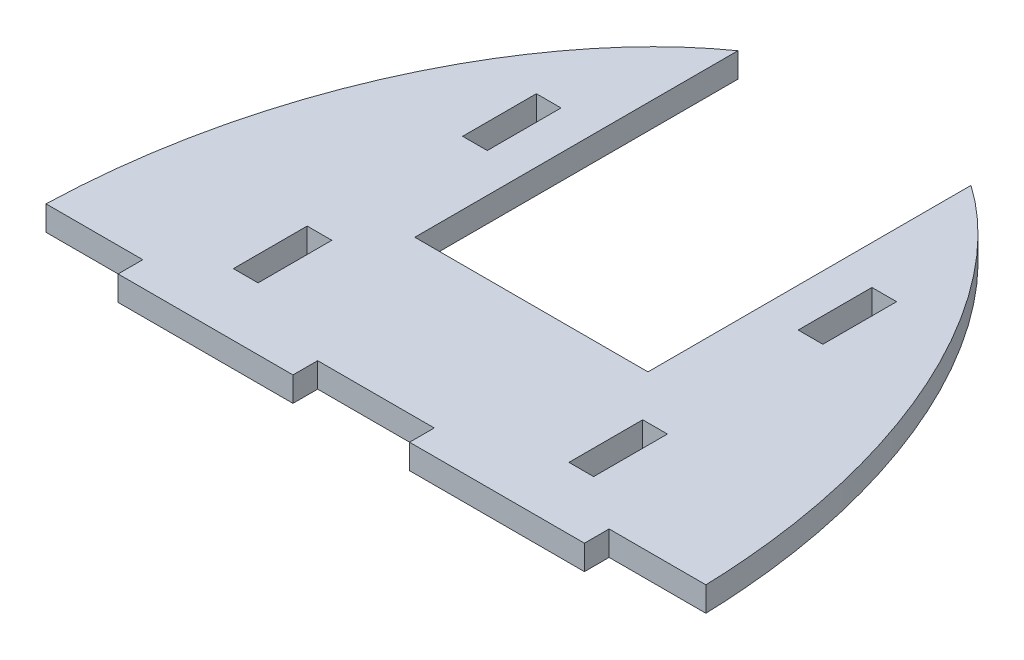
ISO-10303-21;
HEADER;
FILE_DESCRIPTION(('STEP AP214'),'2;1');
FILE_NAME('part.step','',(''),(''),'','','');
FILE_SCHEMA(('AUTOMOTIVE_DESIGN { 1 0 10303 214 1 1 1 1 }'));
ENDSEC;
DATA;
#1=APPLICATION_CONTEXT('core data for automotive mechanical design processes');
#2=APPLICATION_PROTOCOL_DEFINITION('international standard','automotive_design',2000,#1);
#3=PRODUCT_CONTEXT('',#1,'mechanical');
#4=PRODUCT('Part','Part','',(#3));
#5=PRODUCT_RELATED_PRODUCT_CATEGORY('part','',(#4));
#6=PRODUCT_DEFINITION_FORMATION('','',#4);
#7=PRODUCT_DEFINITION_CONTEXT('part definition',#1,'design');
#8=PRODUCT_DEFINITION('design','',#6,#7);
#9=PRODUCT_DEFINITION_SHAPE('','',#8);
#10=(LENGTH_UNIT() NAMED_UNIT(*) SI_UNIT(.MILLI.,.METRE.));
#11=(NAMED_UNIT(*) PLANE_ANGLE_UNIT() SI_UNIT($,.RADIAN.));
#12=(NAMED_UNIT(*) SI_UNIT($,.STERADIAN.) SOLID_ANGLE_UNIT());
#13=UNCERTAINTY_MEASURE_WITH_UNIT(LENGTH_MEASURE(1.E-05),#10,'distance_accuracy_value','');
#14=(GEOMETRIC_REPRESENTATION_CONTEXT(3) GLOBAL_UNCERTAINTY_ASSIGNED_CONTEXT((#13)) GLOBAL_UNIT_ASSIGNED_CONTEXT((#10,
#11,#12)) REPRESENTATION_CONTEXT('',''));
#15=CARTESIAN_POINT('',(0.,0.,0.));
#16=DIRECTION('',(0.,0.,1.));
#17=DIRECTION('',(1.,0.,0.));
#18=AXIS2_PLACEMENT_3D('',#15,#16,#17);
#19=CARTESIAN_POINT('',(0.,3.175,0.));
#20=CARTESIAN_POINT('',(0.,3.175,-36.));
#21=CARTESIAN_POINT('',(22.55,3.175,-70.2833333333334));
#22=CARTESIAN_POINT('',(62.4500000000001,3.175,-70.2833333333333));
#23=CARTESIAN_POINT('',(85.,3.175,-36.0000000000004));
#24=CARTESIAN_POINT('',(85.,3.175,1.08663078535189E-13));
#25=B_SPLINE_CURVE_WITH_KNOTS('',3,(#19,#20,#21,#22,#23,#24),.UNSPECIFIED.,.F.,.F.,(4,1,1,4),
(0.,0.449999999999999,0.549999999999999,1.),.UNSPECIFIED.);
#26=DIRECTION('',(0.,-1.,0.));
#27=VECTOR('',#26,1.);
#28=SURFACE_OF_LINEAR_EXTRUSION('',#25,#27);
#29=DIRECTION('',(0.,-1.,0.));
#30=VECTOR('',#29,1.);
#31=CARTESIAN_POINT('',(0.0479908800301358,3.175,-3.175));
#32=LINE('',#31,#30);
#33=CARTESIAN_POINT('',(0.0479908800301429,3.175,-3.175));
#34=VERTEX_POINT('',#33);
#35=CARTESIAN_POINT('',(0.0479908800301429,0.,-3.175));
#36=VERTEX_POINT('',#35);
#37=EDGE_CURVE('E309',#34,#36,#32,.T.);
#38=ORIENTED_EDGE('',*,*,#37,.F.);
#39=CARTESIAN_POINT('',(27.5,3.175,-64.7387374641124));
#40=VERTEX_POINT('',#39);
#41=EDGE_CURVE('E278',#34,#40,#25,.T.);
#42=ORIENTED_EDGE('',*,*,#41,.T.);
#43=DIRECTION('',(0.,-1.,0.));
#44=VECTOR('',#43,1.);
#45=CARTESIAN_POINT('',(27.5,3.175,-64.7387374694165));
#46=LINE('',#45,#44);
#47=CARTESIAN_POINT('',(27.5,0.,-64.7387374641124));
#48=VERTEX_POINT('',#47);
#49=EDGE_CURVE('E323',#48,#40,#46,.F.);
#50=ORIENTED_EDGE('',*,*,#49,.F.);
#51=CARTESIAN_POINT('',(0.,0.,0.));
#52=CARTESIAN_POINT('',(0.,0.,-36.));
#53=CARTESIAN_POINT('',(22.55,0.,-70.2833333333334));
#54=CARTESIAN_POINT('',(62.4500000000001,0.,-70.2833333333333));
#55=CARTESIAN_POINT('',(85.,0.,-36.0000000000004));
#56=CARTESIAN_POINT('',(85.,0.,1.08663078535189E-13));
#57=B_SPLINE_CURVE_WITH_KNOTS('',3,(#51,#52,#53,#54,#55,#56),.UNSPECIFIED.,.F.,.F.,(4,1,1,4),
(0.,0.449999999999999,0.549999999999999,1.),.UNSPECIFIED.);
#58=EDGE_CURVE('E259',#36,#48,#57,.T.);
#59=ORIENTED_EDGE('',*,*,#58,.F.);
#60=EDGE_LOOP('',(#38,#42,#50,#59));
#61=FACE_BOUND('',#60,.T.);
#62=ADVANCED_FACE('F34',(#61),#28,.T.);
#63=CARTESIAN_POINT('',(0.,3.175,0.));
#64=DIRECTION('',(0.,0.,-1.));
#65=DIRECTION('',(-1.,0.,0.));
#66=AXIS2_PLACEMENT_3D('',#63,#64,#65);
#67=PLANE('',#66);
#68=DIRECTION('',(1.,0.,0.));
#69=VECTOR('',#68,1.);
#70=CARTESIAN_POINT('',(0.,3.175,0.));
#71=LINE('',#70,#69);
#72=CARTESIAN_POINT('',(12.5,3.175,0.));
#73=VERTEX_POINT('',#72);
#74=CARTESIAN_POINT('',(35.,3.175,0.));
#75=VERTEX_POINT('',#74);
#76=EDGE_CURVE('E270',#73,#75,#71,.T.);
#77=ORIENTED_EDGE('',*,*,#76,.F.);
#78=DIRECTION('',(0.,1.,0.));
#79=VECTOR('',#78,1.);
#80=CARTESIAN_POINT('',(12.5,0.,0.));
#81=LINE('',#80,#79);
#82=CARTESIAN_POINT('',(12.5,0.,0.));
#83=VERTEX_POINT('',#82);
#84=EDGE_CURVE('E444',#83,#73,#81,.T.);
#85=ORIENTED_EDGE('',*,*,#84,.F.);
#86=DIRECTION('',(1.,0.,0.));
#87=VECTOR('',#86,1.);
#88=CARTESIAN_POINT('',(0.,0.,0.));
#89=LINE('',#88,#87);
#90=CARTESIAN_POINT('',(35.,0.,0.));
#91=VERTEX_POINT('',#90);
#92=EDGE_CURVE('E258',#83,#91,#89,.T.);
#93=ORIENTED_EDGE('',*,*,#92,.T.);
#94=DIRECTION('',(0.,1.,0.));
#95=VECTOR('',#94,1.);
#96=CARTESIAN_POINT('',(35.,0.,0.));
#97=LINE('',#96,#95);
#98=EDGE_CURVE('E420',#91,#75,#97,.T.);
#99=ORIENTED_EDGE('',*,*,#98,.T.);
#100=EDGE_LOOP('',(#77,#85,#93,#99));
#101=FACE_BOUND('',#100,.T.);
#102=ADVANCED_FACE('F496',(#101),#67,.F.);
#103=DIRECTION('',(0.,-1.,0.));
#104=VECTOR('',#103,1.);
#105=CARTESIAN_POINT('',(84.9520091199699,3.175,-3.17499999999997));
#106=LINE('',#105,#104);
#107=CARTESIAN_POINT('',(84.9520091199699,0.,-3.175));
#108=VERTEX_POINT('',#107);
#109=CARTESIAN_POINT('',(84.9520091199699,3.175,-3.175));
#110=VERTEX_POINT('',#109);
#111=EDGE_CURVE('E321',#108,#110,#106,.F.);
#112=ORIENTED_EDGE('',*,*,#111,.F.);
#113=CARTESIAN_POINT('',(57.5,0.,-64.7387374641124));
#114=VERTEX_POINT('',#113);
#115=EDGE_CURVE('E264',#114,#108,#57,.T.);
#116=ORIENTED_EDGE('',*,*,#115,.F.);
#117=DIRECTION('',(0.,-1.,0.));
#118=VECTOR('',#117,1.);
#119=CARTESIAN_POINT('',(57.5,3.175,-64.7387374694166));
#120=LINE('',#119,#118);
#121=CARTESIAN_POINT('',(57.5,3.175,-64.7387374641124));
#122=VERTEX_POINT('',#121);
#123=EDGE_CURVE('E325',#122,#114,#120,.T.);
#124=ORIENTED_EDGE('',*,*,#123,.F.);
#125=EDGE_CURVE('E262',#122,#110,#25,.T.);
#126=ORIENTED_EDGE('',*,*,#125,.T.);
#127=EDGE_LOOP('',(#112,#116,#124,#126));
#128=FACE_BOUND('',#127,.T.);
#129=ADVANCED_FACE('F36',(#128),#28,.T.);
#130=CARTESIAN_POINT('',(50.,3.175,0.));
#131=VERTEX_POINT('',#130);
#132=CARTESIAN_POINT('',(72.5,3.175,0.));
#133=VERTEX_POINT('',#132);
#134=EDGE_CURVE('E273',#131,#133,#71,.T.);
#135=ORIENTED_EDGE('',*,*,#134,.F.);
#136=DIRECTION('',(0.,1.,0.));
#137=VECTOR('',#136,1.);
#138=CARTESIAN_POINT('',(50.,0.,0.));
#139=LINE('',#138,#137);
#140=CARTESIAN_POINT('',(50.,0.,0.));
#141=VERTEX_POINT('',#140);
#142=EDGE_CURVE('E257',#141,#131,#139,.T.);
#143=ORIENTED_EDGE('',*,*,#142,.F.);
#144=CARTESIAN_POINT('',(72.5,0.,0.));
#145=VERTEX_POINT('',#144);
#146=EDGE_CURVE('E252',#141,#145,#89,.T.);
#147=ORIENTED_EDGE('',*,*,#146,.T.);
#148=DIRECTION('',(0.,1.,0.));
#149=VECTOR('',#148,1.);
#150=CARTESIAN_POINT('',(72.5,0.,0.));
#151=LINE('',#150,#149);
#152=EDGE_CURVE('E231',#145,#133,#151,.T.);
#153=ORIENTED_EDGE('',*,*,#152,.T.);
#154=EDGE_LOOP('',(#135,#143,#147,#153));
#155=FACE_BOUND('',#154,.T.);
#156=ADVANCED_FACE('F256',(#155),#67,.F.);
#157=CARTESIAN_POINT('',(0.,3.175,0.));
#158=DIRECTION('',(0.,1.,0.));
#159=DIRECTION('',(0.,0.,1.));
#160=AXIS2_PLACEMENT_3D('',#157,#158,#159);
#161=PLANE('',#160);
#162=DIRECTION('',(-1.,0.,0.));
#163=VECTOR('',#162,1.);
#164=CARTESIAN_POINT('',(0.,3.175,-3.175));
#165=LINE('',#164,#163);
#166=CARTESIAN_POINT('',(12.5,3.175,-3.175));
#167=VERTEX_POINT('',#166);
#168=EDGE_CURVE('E448',#167,#34,#165,.T.);
#169=ORIENTED_EDGE('',*,*,#168,.F.);
#170=DIRECTION('',(0.,0.,-1.));
#171=VECTOR('',#170,1.);
#172=CARTESIAN_POINT('',(12.5,3.175,0.));
#173=LINE('',#172,#171);
#174=EDGE_CURVE('E429',#73,#167,#173,.T.);
#175=ORIENTED_EDGE('',*,*,#174,.F.);
#176=ORIENTED_EDGE('',*,*,#76,.T.);
#177=DIRECTION('',(0.,0.,1.));
#178=VECTOR('',#177,1.);
#179=CARTESIAN_POINT('',(35.,3.175,0.));
#180=LINE('',#179,#178);
#181=CARTESIAN_POINT('',(35.,3.175,-3.175));
#182=VERTEX_POINT('',#181);
#183=EDGE_CURVE('E243',#182,#75,#180,.T.);
#184=ORIENTED_EDGE('',*,*,#183,.F.);
#185=DIRECTION('',(-1.,0.,0.));
#186=VECTOR('',#185,1.);
#187=CARTESIAN_POINT('',(35.,3.175,-3.175));
#188=LINE('',#187,#186);
#189=CARTESIAN_POINT('',(50.,3.175,-3.175));
#190=VERTEX_POINT('',#189);
#191=EDGE_CURVE('E430',#190,#182,#188,.T.);
#192=ORIENTED_EDGE('',*,*,#191,.F.);
#193=DIRECTION('',(0.,0.,-1.));
#194=VECTOR('',#193,1.);
#195=CARTESIAN_POINT('',(50.,3.175,0.));
#196=LINE('',#195,#194);
#197=EDGE_CURVE('E434',#131,#190,#196,.T.);
#198=ORIENTED_EDGE('',*,*,#197,.F.);
#199=ORIENTED_EDGE('',*,*,#134,.T.);
#200=DIRECTION('',(0.,0.,1.));
#201=VECTOR('',#200,1.);
#202=CARTESIAN_POINT('',(72.5,3.175,0.));
#203=LINE('',#202,#201);
#204=CARTESIAN_POINT('',(72.5,3.175,-3.175));
#205=VERTEX_POINT('',#204);
#206=EDGE_CURVE('E238',#205,#133,#203,.T.);
#207=ORIENTED_EDGE('',*,*,#206,.F.);
#208=DIRECTION('',(-1.,0.,0.));
#209=VECTOR('',#208,1.);
#210=CARTESIAN_POINT('',(85.,3.175,-3.175));
#211=LINE('',#210,#209);
#212=EDGE_CURVE('E462',#110,#205,#211,.T.);
#213=ORIENTED_EDGE('',*,*,#212,.F.);
#214=ORIENTED_EDGE('',*,*,#125,.F.);
#215=DIRECTION('',(0.,0.,-1.));
#216=VECTOR('',#215,1.);
#217=CARTESIAN_POINT('',(57.5,3.175,-78.2349171873449));
#218=LINE('',#217,#216);
#219=CARTESIAN_POINT('',(57.5,3.175,-23.175));
#220=VERTEX_POINT('',#219);
#221=EDGE_CURVE('E463',#220,#122,#218,.T.);
#222=ORIENTED_EDGE('',*,*,#221,.F.);
#223=DIRECTION('',(1.,0.,0.));
#224=VECTOR('',#223,1.);
#225=CARTESIAN_POINT('',(27.5,3.175,-23.175));
#226=LINE('',#225,#224);
#227=CARTESIAN_POINT('',(27.5,3.175,-23.175));
#228=VERTEX_POINT('',#227);
#229=EDGE_CURVE('E466',#228,#220,#226,.T.);
#230=ORIENTED_EDGE('',*,*,#229,.F.);
#231=DIRECTION('',(0.,0.,1.));
#232=VECTOR('',#231,1.);
#233=CARTESIAN_POINT('',(27.5,3.175,-78.2349171873449));
#234=LINE('',#233,#232);
#235=EDGE_CURVE('E469',#40,#228,#234,.T.);
#236=ORIENTED_EDGE('',*,*,#235,.F.);
#237=ORIENTED_EDGE('',*,*,#41,.F.);
#238=EDGE_LOOP('',(#169,#175,#176,#184,#192,#198,#199,#207,#213,#214,#222,#230,#236,#237));
#239=FACE_BOUND('',#238,.T.);
#240=DIRECTION('',(0.,0.,1.));
#241=VECTOR('',#240,1.);
#242=CARTESIAN_POINT('',(62.5000000000007,3.175,-17.5));
#243=LINE('',#242,#241);
#244=CARTESIAN_POINT('',(62.5000000000007,3.175,-17.5));
#245=VERTEX_POINT('',#244);
#246=CARTESIAN_POINT('',(62.5000000000007,3.175,-8.008));
#247=VERTEX_POINT('',#246);
#248=EDGE_CURVE('E50',#245,#247,#243,.T.);
#249=ORIENTED_EDGE('',*,*,#248,.F.);
#250=DIRECTION('',(-1.,0.,0.));
#251=VECTOR('',#250,1.);
#252=CARTESIAN_POINT('',(62.5000000000007,3.175,-17.5));
#253=LINE('',#252,#251);
#254=CARTESIAN_POINT('',(65.6750000000006,3.175,-17.5));
#255=VERTEX_POINT('',#254);
#256=EDGE_CURVE('E337',#255,#245,#253,.T.);
#257=ORIENTED_EDGE('',*,*,#256,.F.);
#258=DIRECTION('',(0.,0.,-1.));
#259=VECTOR('',#258,1.);
#260=CARTESIAN_POINT('',(65.6750000000006,3.175,-17.5));
#261=LINE('',#260,#259);
#262=CARTESIAN_POINT('',(65.6750000000006,3.175,-8.008));
#263=VERTEX_POINT('',#262);
#264=EDGE_CURVE('E341',#263,#255,#261,.T.);
#265=ORIENTED_EDGE('',*,*,#264,.F.);
#266=DIRECTION('',(1.,0.,0.));
#267=VECTOR('',#266,1.);
#268=CARTESIAN_POINT('',(62.5000000000007,3.175,-8.008));
#269=LINE('',#268,#267);
#270=EDGE_CURVE('E344',#247,#263,#269,.T.);
#271=ORIENTED_EDGE('',*,*,#270,.F.);
#272=EDGE_LOOP('',(#249,#257,#265,#271));
#273=FACE_BOUND('',#272,.T.);
#274=DIRECTION('',(0.,0.,1.));
#275=VECTOR('',#274,1.);
#276=CARTESIAN_POINT('',(19.3250000000006,3.175,-17.5));
#277=LINE('',#276,#275);
#278=CARTESIAN_POINT('',(19.3250000000006,3.175,-17.5));
#279=VERTEX_POINT('',#278);
#280=CARTESIAN_POINT('',(19.3250000000007,3.175,-8.008));
#281=VERTEX_POINT('',#280);
#282=EDGE_CURVE('E58',#279,#281,#277,.T.);
#283=ORIENTED_EDGE('',*,*,#282,.F.);
#284=DIRECTION('',(-1.,0.,0.));
#285=VECTOR('',#284,1.);
#286=CARTESIAN_POINT('',(19.3250000000006,3.175,-17.5));
#287=LINE('',#286,#285);
#288=CARTESIAN_POINT('',(22.5000000000006,3.175,-17.5));
#289=VERTEX_POINT('',#288);
#290=EDGE_CURVE('E369',#289,#279,#287,.T.);
#291=ORIENTED_EDGE('',*,*,#290,.F.);
#292=DIRECTION('',(0.,0.,-1.));
#293=VECTOR('',#292,1.);
#294=CARTESIAN_POINT('',(22.5000000000006,3.175,-17.5));
#295=LINE('',#294,#293);
#296=CARTESIAN_POINT('',(22.5000000000006,3.175,-8.008));
#297=VERTEX_POINT('',#296);
#298=EDGE_CURVE('E373',#297,#289,#295,.T.);
#299=ORIENTED_EDGE('',*,*,#298,.F.);
#300=DIRECTION('',(1.,0.,0.));
#301=VECTOR('',#300,1.);
#302=CARTESIAN_POINT('',(19.3250000000007,3.175,-8.008));
#303=LINE('',#302,#301);
#304=EDGE_CURVE('E376',#281,#297,#303,.T.);
#305=ORIENTED_EDGE('',*,*,#304,.F.);
#306=EDGE_LOOP('',(#283,#291,#299,#305));
#307=FACE_BOUND('',#306,.T.);
#308=DIRECTION('',(0.,0.,1.));
#309=VECTOR('',#308,1.);
#310=CARTESIAN_POINT('',(62.5000000000009,3.175,-46.992));
#311=LINE('',#310,#309);
#312=CARTESIAN_POINT('',(62.5000000000009,3.175,-46.992));
#313=VERTEX_POINT('',#312);
#314=CARTESIAN_POINT('',(62.5000000000009,3.175,-37.5));
#315=VERTEX_POINT('',#314);
#316=EDGE_CURVE('E368',#313,#315,#311,.T.);
#317=ORIENTED_EDGE('',*,*,#316,.F.);
#318=DIRECTION('',(-1.,0.,0.));
#319=VECTOR('',#318,1.);
#320=CARTESIAN_POINT('',(62.5000000000009,3.175,-46.992));
#321=LINE('',#320,#319);
#322=CARTESIAN_POINT('',(65.6750000000008,3.175,-46.992));
#323=VERTEX_POINT('',#322);
#324=EDGE_CURVE('E399',#323,#313,#321,.T.);
#325=ORIENTED_EDGE('',*,*,#324,.F.);
#326=DIRECTION('',(0.,0.,-1.));
#327=VECTOR('',#326,1.);
#328=CARTESIAN_POINT('',(65.6750000000008,3.175,-46.992));
#329=LINE('',#328,#327);
#330=CARTESIAN_POINT('',(65.6750000000008,3.175,-37.5));
#331=VERTEX_POINT('',#330);
#332=EDGE_CURVE('E403',#331,#323,#329,.T.);
#333=ORIENTED_EDGE('',*,*,#332,.F.);
#334=DIRECTION('',(1.,0.,0.));
#335=VECTOR('',#334,1.);
#336=CARTESIAN_POINT('',(62.5000000000009,3.175,-37.5));
#337=LINE('',#336,#335);
#338=EDGE_CURVE('E406',#315,#331,#337,.T.);
#339=ORIENTED_EDGE('',*,*,#338,.F.);
#340=EDGE_LOOP('',(#317,#325,#333,#339));
#341=FACE_BOUND('',#340,.T.);
#342=DIRECTION('',(0.,0.,1.));
#343=VECTOR('',#342,1.);
#344=CARTESIAN_POINT('',(19.3250000000009,3.175,-46.992));
#345=LINE('',#344,#343);
#346=CARTESIAN_POINT('',(19.3250000000009,3.175,-46.992));
#347=VERTEX_POINT('',#346);
#348=CARTESIAN_POINT('',(19.3250000000008,3.175,-37.5));
#349=VERTEX_POINT('',#348);
#350=EDGE_CURVE('E307',#347,#349,#345,.T.);
#351=ORIENTED_EDGE('',*,*,#350,.F.);
#352=DIRECTION('',(-1.,0.,0.));
#353=VECTOR('',#352,1.);
#354=CARTESIAN_POINT('',(19.3250000000009,3.175,-46.992));
#355=LINE('',#354,#353);
#356=CARTESIAN_POINT('',(22.5000000000008,3.175,-46.992));
#357=VERTEX_POINT('',#356);
#358=EDGE_CURVE('E297',#357,#347,#355,.T.);
#359=ORIENTED_EDGE('',*,*,#358,.F.);
#360=DIRECTION('',(0.,0.,-1.));
#361=VECTOR('',#360,1.);
#362=CARTESIAN_POINT('',(22.5000000000008,3.175,-46.992));
#363=LINE('',#362,#361);
#364=CARTESIAN_POINT('',(22.5000000000008,3.175,-37.5));
#365=VERTEX_POINT('',#364);
#366=EDGE_CURVE('E301',#365,#357,#363,.T.);
#367=ORIENTED_EDGE('',*,*,#366,.F.);
#368=DIRECTION('',(1.,0.,0.));
#369=VECTOR('',#368,1.);
#370=CARTESIAN_POINT('',(19.3250000000008,3.175,-37.5));
#371=LINE('',#370,#369);
#372=EDGE_CURVE('E304',#349,#365,#371,.T.);
#373=ORIENTED_EDGE('',*,*,#372,.F.);
#374=EDGE_LOOP('',(#351,#359,#367,#373));
#375=FACE_BOUND('',#374,.T.);
#376=ADVANCED_FACE('F482',(#239,#273,#307,#341,#375),#161,.T.);
#377=CARTESIAN_POINT('',(0.,0.,0.));
#378=DIRECTION('',(0.,1.,0.));
#379=DIRECTION('',(0.,0.,1.));
#380=AXIS2_PLACEMENT_3D('',#377,#378,#379);
#381=PLANE('',#380);
#382=DIRECTION('',(0.,0.,-1.));
#383=VECTOR('',#382,1.);
#384=CARTESIAN_POINT('',(12.5,0.,0.));
#385=LINE('',#384,#383);
#386=CARTESIAN_POINT('',(12.5,0.,-3.175));
#387=VERTEX_POINT('',#386);
#388=EDGE_CURVE('E450',#83,#387,#385,.T.);
#389=ORIENTED_EDGE('',*,*,#388,.T.);
#390=DIRECTION('',(-1.,0.,0.));
#391=VECTOR('',#390,1.);
#392=CARTESIAN_POINT('',(0.,0.,-3.175));
#393=LINE('',#392,#391);
#394=EDGE_CURVE('E446',#387,#36,#393,.T.);
#395=ORIENTED_EDGE('',*,*,#394,.T.);
#396=ORIENTED_EDGE('',*,*,#58,.T.);
#397=DIRECTION('',(0.,0.,1.));
#398=VECTOR('',#397,1.);
#399=CARTESIAN_POINT('',(27.5,0.,0.));
#400=LINE('',#399,#398);
#401=CARTESIAN_POINT('',(27.5,0.,-23.175));
#402=VERTEX_POINT('',#401);
#403=EDGE_CURVE('E43',#48,#402,#400,.T.);
#404=ORIENTED_EDGE('',*,*,#403,.T.);
#405=DIRECTION('',(1.,0.,0.));
#406=VECTOR('',#405,1.);
#407=CARTESIAN_POINT('',(27.5,0.,-23.175));
#408=LINE('',#407,#406);
#409=CARTESIAN_POINT('',(57.5,0.,-23.175));
#410=VERTEX_POINT('',#409);
#411=EDGE_CURVE('E465',#402,#410,#408,.T.);
#412=ORIENTED_EDGE('',*,*,#411,.T.);
#413=DIRECTION('',(0.,0.,-1.));
#414=VECTOR('',#413,1.);
#415=CARTESIAN_POINT('',(57.5,0.,-78.2349171873449));
#416=LINE('',#415,#414);
#417=EDGE_CURVE('E460',#410,#114,#416,.T.);
#418=ORIENTED_EDGE('',*,*,#417,.T.);
#419=ORIENTED_EDGE('',*,*,#115,.T.);
#420=DIRECTION('',(-1.,0.,0.));
#421=VECTOR('',#420,1.);
#422=CARTESIAN_POINT('',(0.,0.,-3.175));
#423=LINE('',#422,#421);
#424=CARTESIAN_POINT('',(72.5,0.,-3.175));
#425=VERTEX_POINT('',#424);
#426=EDGE_CURVE('E11',#108,#425,#423,.T.);
#427=ORIENTED_EDGE('',*,*,#426,.T.);
#428=DIRECTION('',(0.,0.,1.));
#429=VECTOR('',#428,1.);
#430=CARTESIAN_POINT('',(72.5,0.,0.));
#431=LINE('',#430,#429);
#432=EDGE_CURVE('E235',#425,#145,#431,.T.);
#433=ORIENTED_EDGE('',*,*,#432,.T.);
#434=ORIENTED_EDGE('',*,*,#146,.F.);
#435=DIRECTION('',(0.,0.,-1.));
#436=VECTOR('',#435,1.);
#437=CARTESIAN_POINT('',(50.,0.,0.));
#438=LINE('',#437,#436);
#439=CARTESIAN_POINT('',(50.,0.,-3.175));
#440=VERTEX_POINT('',#439);
#441=EDGE_CURVE('E440',#141,#440,#438,.T.);
#442=ORIENTED_EDGE('',*,*,#441,.T.);
#443=DIRECTION('',(-1.,0.,0.));
#444=VECTOR('',#443,1.);
#445=CARTESIAN_POINT('',(35.,0.,-3.175));
#446=LINE('',#445,#444);
#447=CARTESIAN_POINT('',(35.,0.,-3.175));
#448=VERTEX_POINT('',#447);
#449=EDGE_CURVE('E423',#440,#448,#446,.T.);
#450=ORIENTED_EDGE('',*,*,#449,.T.);
#451=DIRECTION('',(0.,0.,1.));
#452=VECTOR('',#451,1.);
#453=CARTESIAN_POINT('',(35.,0.,0.));
#454=LINE('',#453,#452);
#455=EDGE_CURVE('E433',#448,#91,#454,.T.);
#456=ORIENTED_EDGE('',*,*,#455,.T.);
#457=ORIENTED_EDGE('',*,*,#92,.F.);
#458=EDGE_LOOP('',(#389,#395,#396,#404,#412,#418,#419,#427,#433,#434,#442,#450,#456,#457));
#459=FACE_BOUND('',#458,.T.);
#460=DIRECTION('',(-1.,0.,0.));
#461=VECTOR('',#460,1.);
#462=CARTESIAN_POINT('',(62.5000000000007,0.,-17.5));
#463=LINE('',#462,#461);
#464=CARTESIAN_POINT('',(65.6750000000006,0.,-17.5));
#465=VERTEX_POINT('',#464);
#466=CARTESIAN_POINT('',(62.5000000000007,0.,-17.5));
#467=VERTEX_POINT('',#466);
#468=EDGE_CURVE('E331',#465,#467,#463,.T.);
#469=ORIENTED_EDGE('',*,*,#468,.T.);
#470=DIRECTION('',(0.,0.,1.));
#471=VECTOR('',#470,1.);
#472=CARTESIAN_POINT('',(62.5000000000007,0.,-17.5));
#473=LINE('',#472,#471);
#474=CARTESIAN_POINT('',(62.5000000000007,0.,-8.008));
#475=VERTEX_POINT('',#474);
#476=EDGE_CURVE('E340',#467,#475,#473,.T.);
#477=ORIENTED_EDGE('',*,*,#476,.T.);
#478=DIRECTION('',(1.,0.,0.));
#479=VECTOR('',#478,1.);
#480=CARTESIAN_POINT('',(62.5000000000007,0.,-8.008));
#481=LINE('',#480,#479);
#482=CARTESIAN_POINT('',(65.6750000000006,0.,-8.008));
#483=VERTEX_POINT('',#482);
#484=EDGE_CURVE('E354',#475,#483,#481,.T.);
#485=ORIENTED_EDGE('',*,*,#484,.T.);
#486=DIRECTION('',(0.,0.,-1.));
#487=VECTOR('',#486,1.);
#488=CARTESIAN_POINT('',(65.6750000000006,0.,-17.5));
#489=LINE('',#488,#487);
#490=EDGE_CURVE('E351',#483,#465,#489,.T.);
#491=ORIENTED_EDGE('',*,*,#490,.T.);
#492=EDGE_LOOP('',(#469,#477,#485,#491));
#493=FACE_BOUND('',#492,.T.);
#494=DIRECTION('',(-1.,0.,0.));
#495=VECTOR('',#494,1.);
#496=CARTESIAN_POINT('',(19.3250000000006,0.,-17.5));
#497=LINE('',#496,#495);
#498=CARTESIAN_POINT('',(22.5000000000006,0.,-17.5));
#499=VERTEX_POINT('',#498);
#500=CARTESIAN_POINT('',(19.3250000000006,0.,-17.5));
#501=VERTEX_POINT('',#500);
#502=EDGE_CURVE('E362',#499,#501,#497,.T.);
#503=ORIENTED_EDGE('',*,*,#502,.T.);
#504=DIRECTION('',(0.,0.,1.));
#505=VECTOR('',#504,1.);
#506=CARTESIAN_POINT('',(19.3250000000006,0.,-17.5));
#507=LINE('',#506,#505);
#508=CARTESIAN_POINT('',(19.3250000000007,0.,-8.008));
#509=VERTEX_POINT('',#508);
#510=EDGE_CURVE('E372',#501,#509,#507,.T.);
#511=ORIENTED_EDGE('',*,*,#510,.T.);
#512=DIRECTION('',(1.,0.,0.));
#513=VECTOR('',#512,1.);
#514=CARTESIAN_POINT('',(19.3250000000007,0.,-8.008));
#515=LINE('',#514,#513);
#516=CARTESIAN_POINT('',(22.5000000000006,0.,-8.008));
#517=VERTEX_POINT('',#516);
#518=EDGE_CURVE('E385',#509,#517,#515,.T.);
#519=ORIENTED_EDGE('',*,*,#518,.T.);
#520=DIRECTION('',(0.,0.,-1.));
#521=VECTOR('',#520,1.);
#522=CARTESIAN_POINT('',(22.5000000000006,0.,-17.5));
#523=LINE('',#522,#521);
#524=EDGE_CURVE('E382',#517,#499,#523,.T.);
#525=ORIENTED_EDGE('',*,*,#524,.T.);
#526=EDGE_LOOP('',(#503,#511,#519,#525));
#527=FACE_BOUND('',#526,.T.);
#528=DIRECTION('',(-1.,0.,0.));
#529=VECTOR('',#528,1.);
#530=CARTESIAN_POINT('',(62.5000000000009,0.,-46.992));
#531=LINE('',#530,#529);
#532=CARTESIAN_POINT('',(65.6750000000008,0.,-46.992));
#533=VERTEX_POINT('',#532);
#534=CARTESIAN_POINT('',(62.5000000000009,0.,-46.992));
#535=VERTEX_POINT('',#534);
#536=EDGE_CURVE('E394',#533,#535,#531,.T.);
#537=ORIENTED_EDGE('',*,*,#536,.T.);
#538=DIRECTION('',(0.,0.,1.));
#539=VECTOR('',#538,1.);
#540=CARTESIAN_POINT('',(62.5000000000009,0.,-46.992));
#541=LINE('',#540,#539);
#542=CARTESIAN_POINT('',(62.5000000000009,0.,-37.5));
#543=VERTEX_POINT('',#542);
#544=EDGE_CURVE('E402',#535,#543,#541,.T.);
#545=ORIENTED_EDGE('',*,*,#544,.T.);
#546=DIRECTION('',(1.,0.,0.));
#547=VECTOR('',#546,1.);
#548=CARTESIAN_POINT('',(62.5000000000009,0.,-37.5));
#549=LINE('',#548,#547);
#550=CARTESIAN_POINT('',(65.6750000000008,0.,-37.5));
#551=VERTEX_POINT('',#550);
#552=EDGE_CURVE('E415',#543,#551,#549,.T.);
#553=ORIENTED_EDGE('',*,*,#552,.T.);
#554=DIRECTION('',(0.,0.,-1.));
#555=VECTOR('',#554,1.);
#556=CARTESIAN_POINT('',(65.6750000000008,0.,-46.992));
#557=LINE('',#556,#555);
#558=EDGE_CURVE('E412',#551,#533,#557,.T.);
#559=ORIENTED_EDGE('',*,*,#558,.T.);
#560=EDGE_LOOP('',(#537,#545,#553,#559));
#561=FACE_BOUND('',#560,.T.);
#562=DIRECTION('',(-1.,0.,0.));
#563=VECTOR('',#562,1.);
#564=CARTESIAN_POINT('',(19.3250000000009,0.,-46.992));
#565=LINE('',#564,#563);
#566=CARTESIAN_POINT('',(22.5000000000008,0.,-46.992));
#567=VERTEX_POINT('',#566);
#568=CARTESIAN_POINT('',(19.3250000000009,0.,-46.992));
#569=VERTEX_POINT('',#568);
#570=EDGE_CURVE('E291',#567,#569,#565,.T.);
#571=ORIENTED_EDGE('',*,*,#570,.T.);
#572=DIRECTION('',(0.,0.,1.));
#573=VECTOR('',#572,1.);
#574=CARTESIAN_POINT('',(19.3250000000009,0.,-46.992));
#575=LINE('',#574,#573);
#576=CARTESIAN_POINT('',(19.3250000000008,0.,-37.5));
#577=VERTEX_POINT('',#576);
#578=EDGE_CURVE('E300',#569,#577,#575,.T.);
#579=ORIENTED_EDGE('',*,*,#578,.T.);
#580=DIRECTION('',(1.,0.,0.));
#581=VECTOR('',#580,1.);
#582=CARTESIAN_POINT('',(19.3250000000008,0.,-37.5));
#583=LINE('',#582,#581);
#584=CARTESIAN_POINT('',(22.5000000000008,0.,-37.5));
#585=VERTEX_POINT('',#584);
#586=EDGE_CURVE('E315',#577,#585,#583,.T.);
#587=ORIENTED_EDGE('',*,*,#586,.T.);
#588=DIRECTION('',(0.,0.,-1.));
#589=VECTOR('',#588,1.);
#590=CARTESIAN_POINT('',(22.5000000000008,0.,-46.992));
#591=LINE('',#590,#589);
#592=EDGE_CURVE('E312',#585,#567,#591,.T.);
#593=ORIENTED_EDGE('',*,*,#592,.T.);
#594=EDGE_LOOP('',(#571,#579,#587,#593));
#595=FACE_BOUND('',#594,.T.);
#596=ADVANCED_FACE('F249',(#459,#493,#527,#561,#595),#381,.F.);
#597=CARTESIAN_POINT('',(19.3250000000009,0.,-46.992));
#598=DIRECTION('',(-1.,0.,0.));
#599=DIRECTION('',(0.,0.,1.));
#600=AXIS2_PLACEMENT_3D('',#597,#598,#599);
#601=PLANE('',#600);
#602=ORIENTED_EDGE('',*,*,#350,.T.);
#603=DIRECTION('',(0.,1.,0.));
#604=VECTOR('',#603,1.);
#605=CARTESIAN_POINT('',(19.3250000000008,0.,-37.5));
#606=LINE('',#605,#604);
#607=EDGE_CURVE('E284',#577,#349,#606,.T.);
#608=ORIENTED_EDGE('',*,*,#607,.F.);
#609=ORIENTED_EDGE('',*,*,#578,.F.);
#610=DIRECTION('',(0.,1.,0.));
#611=VECTOR('',#610,1.);
#612=CARTESIAN_POINT('',(19.3250000000009,0.,-46.992));
#613=LINE('',#612,#611);
#614=EDGE_CURVE('E295',#569,#347,#613,.T.);
#615=ORIENTED_EDGE('',*,*,#614,.T.);
#616=EDGE_LOOP('',(#602,#608,#609,#615));
#617=FACE_BOUND('',#616,.T.);
#618=ADVANCED_FACE('F547',(#617),#601,.F.);
#619=CARTESIAN_POINT('',(19.3250000000009,0.,-46.992));
#620=DIRECTION('',(0.,0.,-1.));
#621=DIRECTION('',(-1.,0.,0.));
#622=AXIS2_PLACEMENT_3D('',#619,#620,#621);
#623=PLANE('',#622);
#624=ORIENTED_EDGE('',*,*,#358,.T.);
#625=ORIENTED_EDGE('',*,*,#614,.F.);
#626=ORIENTED_EDGE('',*,*,#570,.F.);
#627=DIRECTION('',(0.,1.,0.));
#628=VECTOR('',#627,1.);
#629=CARTESIAN_POINT('',(22.5000000000008,0.,-46.992));
#630=LINE('',#629,#628);
#631=EDGE_CURVE('E293',#567,#357,#630,.T.);
#632=ORIENTED_EDGE('',*,*,#631,.T.);
#633=EDGE_LOOP('',(#624,#625,#626,#632));
#634=FACE_BOUND('',#633,.T.);
#635=ADVANCED_FACE('F551',(#634),#623,.F.);
#636=CARTESIAN_POINT('',(22.5000000000008,0.,-46.992));
#637=DIRECTION('',(1.,0.,0.));
#638=DIRECTION('',(0.,0.,-1.));
#639=AXIS2_PLACEMENT_3D('',#636,#637,#638);
#640=PLANE('',#639);
#641=ORIENTED_EDGE('',*,*,#366,.T.);
#642=ORIENTED_EDGE('',*,*,#631,.F.);
#643=ORIENTED_EDGE('',*,*,#592,.F.);
#644=DIRECTION('',(0.,1.,0.));
#645=VECTOR('',#644,1.);
#646=CARTESIAN_POINT('',(22.5000000000008,0.,-37.5));
#647=LINE('',#646,#645);
#648=EDGE_CURVE('E290',#585,#365,#647,.T.);
#649=ORIENTED_EDGE('',*,*,#648,.T.);
#650=EDGE_LOOP('',(#641,#642,#643,#649));
#651=FACE_BOUND('',#650,.T.);
#652=ADVANCED_FACE('F557',(#651),#640,.F.);
#653=CARTESIAN_POINT('',(19.3250000000008,0.,-37.5));
#654=DIRECTION('',(0.,0.,1.));
#655=DIRECTION('',(1.,0.,0.));
#656=AXIS2_PLACEMENT_3D('',#653,#654,#655);
#657=PLANE('',#656);
#658=ORIENTED_EDGE('',*,*,#372,.T.);
#659=ORIENTED_EDGE('',*,*,#648,.F.);
#660=ORIENTED_EDGE('',*,*,#586,.F.);
#661=ORIENTED_EDGE('',*,*,#607,.T.);
#662=EDGE_LOOP('',(#658,#659,#660,#661));
#663=FACE_BOUND('',#662,.T.);
#664=ADVANCED_FACE('F553',(#663),#657,.F.);
#665=CARTESIAN_POINT('',(62.5000000000009,0.,-46.992));
#666=DIRECTION('',(-1.,0.,0.));
#667=DIRECTION('',(0.,0.,1.));
#668=AXIS2_PLACEMENT_3D('',#665,#666,#667);
#669=PLANE('',#668);
#670=ORIENTED_EDGE('',*,*,#316,.T.);
#671=DIRECTION('',(0.,1.,0.));
#672=VECTOR('',#671,1.);
#673=CARTESIAN_POINT('',(62.5000000000009,0.,-37.5));
#674=LINE('',#673,#672);
#675=EDGE_CURVE('E390',#543,#315,#674,.T.);
#676=ORIENTED_EDGE('',*,*,#675,.F.);
#677=ORIENTED_EDGE('',*,*,#544,.F.);
#678=DIRECTION('',(0.,1.,0.));
#679=VECTOR('',#678,1.);
#680=CARTESIAN_POINT('',(62.5000000000009,0.,-46.992));
#681=LINE('',#680,#679);
#682=EDGE_CURVE('E327',#535,#313,#681,.T.);
#683=ORIENTED_EDGE('',*,*,#682,.T.);
#684=EDGE_LOOP('',(#670,#676,#677,#683));
#685=FACE_BOUND('',#684,.T.);
#686=ADVANCED_FACE('F556',(#685),#669,.F.);
#687=CARTESIAN_POINT('',(62.5000000000009,0.,-46.992));
#688=DIRECTION('',(0.,0.,-1.));
#689=DIRECTION('',(-1.,0.,0.));
#690=AXIS2_PLACEMENT_3D('',#687,#688,#689);
#691=PLANE('',#690);
#692=ORIENTED_EDGE('',*,*,#324,.T.);
#693=ORIENTED_EDGE('',*,*,#682,.F.);
#694=ORIENTED_EDGE('',*,*,#536,.F.);
#695=DIRECTION('',(0.,1.,0.));
#696=VECTOR('',#695,1.);
#697=CARTESIAN_POINT('',(65.6750000000008,0.,-46.992));
#698=LINE('',#697,#696);
#699=EDGE_CURVE('E396',#533,#323,#698,.T.);
#700=ORIENTED_EDGE('',*,*,#699,.T.);
#701=EDGE_LOOP('',(#692,#693,#694,#700));
#702=FACE_BOUND('',#701,.T.);
#703=ADVANCED_FACE('F597',(#702),#691,.F.);
#704=CARTESIAN_POINT('',(65.6750000000008,0.,-46.992));
#705=DIRECTION('',(1.,0.,0.));
#706=DIRECTION('',(0.,0.,-1.));
#707=AXIS2_PLACEMENT_3D('',#704,#705,#706);
#708=PLANE('',#707);
#709=ORIENTED_EDGE('',*,*,#332,.T.);
#710=ORIENTED_EDGE('',*,*,#699,.F.);
#711=ORIENTED_EDGE('',*,*,#558,.F.);
#712=DIRECTION('',(0.,1.,0.));
#713=VECTOR('',#712,1.);
#714=CARTESIAN_POINT('',(65.6750000000008,0.,-37.5));
#715=LINE('',#714,#713);
#716=EDGE_CURVE('E393',#551,#331,#715,.T.);
#717=ORIENTED_EDGE('',*,*,#716,.T.);
#718=EDGE_LOOP('',(#709,#710,#711,#717));
#719=FACE_BOUND('',#718,.T.);
#720=ADVANCED_FACE('F601',(#719),#708,.F.);
#721=CARTESIAN_POINT('',(62.5000000000009,0.,-37.5));
#722=DIRECTION('',(0.,0.,1.));
#723=DIRECTION('',(1.,0.,0.));
#724=AXIS2_PLACEMENT_3D('',#721,#722,#723);
#725=PLANE('',#724);
#726=ORIENTED_EDGE('',*,*,#338,.T.);
#727=ORIENTED_EDGE('',*,*,#716,.F.);
#728=ORIENTED_EDGE('',*,*,#552,.F.);
#729=ORIENTED_EDGE('',*,*,#675,.T.);
#730=EDGE_LOOP('',(#726,#727,#728,#729));
#731=FACE_BOUND('',#730,.T.);
#732=ADVANCED_FACE('F584',(#731),#725,.F.);
#733=CARTESIAN_POINT('',(19.3250000000006,0.,-17.5));
#734=DIRECTION('',(-1.,0.,0.));
#735=DIRECTION('',(0.,0.,1.));
#736=AXIS2_PLACEMENT_3D('',#733,#734,#735);
#737=PLANE('',#736);
#738=ORIENTED_EDGE('',*,*,#282,.T.);
#739=DIRECTION('',(0.,1.,0.));
#740=VECTOR('',#739,1.);
#741=CARTESIAN_POINT('',(19.3250000000007,0.,-8.008));
#742=LINE('',#741,#740);
#743=EDGE_CURVE('E359',#509,#281,#742,.T.);
#744=ORIENTED_EDGE('',*,*,#743,.F.);
#745=ORIENTED_EDGE('',*,*,#510,.F.);
#746=DIRECTION('',(0.,1.,0.));
#747=VECTOR('',#746,1.);
#748=CARTESIAN_POINT('',(19.3250000000006,0.,-17.5));
#749=LINE('',#748,#747);
#750=EDGE_CURVE('E366',#501,#279,#749,.T.);
#751=ORIENTED_EDGE('',*,*,#750,.T.);
#752=EDGE_LOOP('',(#738,#744,#745,#751));
#753=FACE_BOUND('',#752,.T.);
#754=ADVANCED_FACE('F580',(#753),#737,.F.);
#755=CARTESIAN_POINT('',(19.3250000000006,0.,-17.5));
#756=DIRECTION('',(0.,0.,-1.));
#757=DIRECTION('',(-1.,0.,0.));
#758=AXIS2_PLACEMENT_3D('',#755,#756,#757);
#759=PLANE('',#758);
#760=ORIENTED_EDGE('',*,*,#290,.T.);
#761=ORIENTED_EDGE('',*,*,#750,.F.);
#762=ORIENTED_EDGE('',*,*,#502,.F.);
#763=DIRECTION('',(0.,1.,0.));
#764=VECTOR('',#763,1.);
#765=CARTESIAN_POINT('',(22.5000000000006,0.,-17.5));
#766=LINE('',#765,#764);
#767=EDGE_CURVE('E364',#499,#289,#766,.T.);
#768=ORIENTED_EDGE('',*,*,#767,.T.);
#769=EDGE_LOOP('',(#760,#761,#762,#768));
#770=FACE_BOUND('',#769,.T.);
#771=ADVANCED_FACE('F583',(#770),#759,.F.);
#772=CARTESIAN_POINT('',(22.5000000000006,0.,-17.5));
#773=DIRECTION('',(1.,0.,0.));
#774=DIRECTION('',(0.,0.,-1.));
#775=AXIS2_PLACEMENT_3D('',#772,#773,#774);
#776=PLANE('',#775);
#777=ORIENTED_EDGE('',*,*,#298,.T.);
#778=ORIENTED_EDGE('',*,*,#767,.F.);
#779=ORIENTED_EDGE('',*,*,#524,.F.);
#780=DIRECTION('',(0.,1.,0.));
#781=VECTOR('',#780,1.);
#782=CARTESIAN_POINT('',(22.5000000000006,0.,-8.008));
#783=LINE('',#782,#781);
#784=EDGE_CURVE('E361',#517,#297,#783,.T.);
#785=ORIENTED_EDGE('',*,*,#784,.T.);
#786=EDGE_LOOP('',(#777,#778,#779,#785));
#787=FACE_BOUND('',#786,.T.);
#788=ADVANCED_FACE('F587',(#787),#776,.F.);
#789=CARTESIAN_POINT('',(19.3250000000007,0.,-8.008));
#790=DIRECTION('',(0.,0.,1.));
#791=DIRECTION('',(1.,0.,0.));
#792=AXIS2_PLACEMENT_3D('',#789,#790,#791);
#793=PLANE('',#792);
#794=ORIENTED_EDGE('',*,*,#304,.T.);
#795=ORIENTED_EDGE('',*,*,#784,.F.);
#796=ORIENTED_EDGE('',*,*,#518,.F.);
#797=ORIENTED_EDGE('',*,*,#743,.T.);
#798=EDGE_LOOP('',(#794,#795,#796,#797));
#799=FACE_BOUND('',#798,.T.);
#800=ADVANCED_FACE('F569',(#799),#793,.F.);
#801=CARTESIAN_POINT('',(62.5000000000007,0.,-17.5));
#802=DIRECTION('',(-1.,0.,0.));
#803=DIRECTION('',(0.,0.,1.));
#804=AXIS2_PLACEMENT_3D('',#801,#802,#803);
#805=PLANE('',#804);
#806=ORIENTED_EDGE('',*,*,#248,.T.);
#807=DIRECTION('',(0.,1.,0.));
#808=VECTOR('',#807,1.);
#809=CARTESIAN_POINT('',(62.5000000000007,0.,-8.008));
#810=LINE('',#809,#808);
#811=EDGE_CURVE('E328',#475,#247,#810,.T.);
#812=ORIENTED_EDGE('',*,*,#811,.F.);
#813=ORIENTED_EDGE('',*,*,#476,.F.);
#814=DIRECTION('',(0.,1.,0.));
#815=VECTOR('',#814,1.);
#816=CARTESIAN_POINT('',(62.5000000000007,0.,-17.5));
#817=LINE('',#816,#815);
#818=EDGE_CURVE('E335',#467,#245,#817,.T.);
#819=ORIENTED_EDGE('',*,*,#818,.T.);
#820=EDGE_LOOP('',(#806,#812,#813,#819));
#821=FACE_BOUND('',#820,.T.);
#822=ADVANCED_FACE('F565',(#821),#805,.F.);
#823=CARTESIAN_POINT('',(62.5000000000007,0.,-17.5));
#824=DIRECTION('',(0.,0.,-1.));
#825=DIRECTION('',(-1.,0.,0.));
#826=AXIS2_PLACEMENT_3D('',#823,#824,#825);
#827=PLANE('',#826);
#828=ORIENTED_EDGE('',*,*,#256,.T.);
#829=ORIENTED_EDGE('',*,*,#818,.F.);
#830=ORIENTED_EDGE('',*,*,#468,.F.);
#831=DIRECTION('',(0.,1.,0.));
#832=VECTOR('',#831,1.);
#833=CARTESIAN_POINT('',(65.6750000000006,0.,-17.5));
#834=LINE('',#833,#832);
#835=EDGE_CURVE('E333',#465,#255,#834,.T.);
#836=ORIENTED_EDGE('',*,*,#835,.T.);
#837=EDGE_LOOP('',(#828,#829,#830,#836));
#838=FACE_BOUND('',#837,.T.);
#839=ADVANCED_FACE('F568',(#838),#827,.F.);
#840=CARTESIAN_POINT('',(65.6750000000006,0.,-17.5));
#841=DIRECTION('',(1.,0.,0.));
#842=DIRECTION('',(0.,0.,-1.));
#843=AXIS2_PLACEMENT_3D('',#840,#841,#842);
#844=PLANE('',#843);
#845=ORIENTED_EDGE('',*,*,#264,.T.);
#846=ORIENTED_EDGE('',*,*,#835,.F.);
#847=ORIENTED_EDGE('',*,*,#490,.F.);
#848=DIRECTION('',(0.,1.,0.));
#849=VECTOR('',#848,1.);
#850=CARTESIAN_POINT('',(65.6750000000006,0.,-8.008));
#851=LINE('',#850,#849);
#852=EDGE_CURVE('E330',#483,#263,#851,.T.);
#853=ORIENTED_EDGE('',*,*,#852,.T.);
#854=EDGE_LOOP('',(#845,#846,#847,#853));
#855=FACE_BOUND('',#854,.T.);
#856=ADVANCED_FACE('F572',(#855),#844,.F.);
#857=CARTESIAN_POINT('',(62.5000000000007,0.,-8.008));
#858=DIRECTION('',(0.,0.,1.));
#859=DIRECTION('',(1.,0.,0.));
#860=AXIS2_PLACEMENT_3D('',#857,#858,#859);
#861=PLANE('',#860);
#862=ORIENTED_EDGE('',*,*,#270,.T.);
#863=ORIENTED_EDGE('',*,*,#852,.F.);
#864=ORIENTED_EDGE('',*,*,#484,.F.);
#865=ORIENTED_EDGE('',*,*,#811,.T.);
#866=EDGE_LOOP('',(#862,#863,#864,#865));
#867=FACE_BOUND('',#866,.T.);
#868=ADVANCED_FACE('F530',(#867),#861,.F.);
#869=CARTESIAN_POINT('',(27.5,0.,-78.2349171873449));
#870=DIRECTION('',(-1.,0.,0.));
#871=DIRECTION('',(0.,0.,1.));
#872=AXIS2_PLACEMENT_3D('',#869,#870,#871);
#873=PLANE('',#872);
#874=ORIENTED_EDGE('',*,*,#49,.T.);
#875=ORIENTED_EDGE('',*,*,#235,.T.);
#876=DIRECTION('',(0.,1.,0.));
#877=VECTOR('',#876,1.);
#878=CARTESIAN_POINT('',(27.5,0.,-23.175));
#879=LINE('',#878,#877);
#880=EDGE_CURVE('E456',#402,#228,#879,.T.);
#881=ORIENTED_EDGE('',*,*,#880,.F.);
#882=ORIENTED_EDGE('',*,*,#403,.F.);
#883=EDGE_LOOP('',(#874,#875,#881,#882));
#884=FACE_BOUND('',#883,.T.);
#885=ADVANCED_FACE('F513',(#884),#873,.F.);
#886=CARTESIAN_POINT('',(57.5,0.,-78.2349171873449));
#887=DIRECTION('',(1.,0.,0.));
#888=DIRECTION('',(0.,0.,-1.));
#889=AXIS2_PLACEMENT_3D('',#886,#887,#888);
#890=PLANE('',#889);
#891=ORIENTED_EDGE('',*,*,#123,.T.);
#892=ORIENTED_EDGE('',*,*,#417,.F.);
#893=DIRECTION('',(0.,1.,0.));
#894=VECTOR('',#893,1.);
#895=CARTESIAN_POINT('',(57.5,0.,-23.175));
#896=LINE('',#895,#894);
#897=EDGE_CURVE('E459',#410,#220,#896,.T.);
#898=ORIENTED_EDGE('',*,*,#897,.T.);
#899=ORIENTED_EDGE('',*,*,#221,.T.);
#900=EDGE_LOOP('',(#891,#892,#898,#899));
#901=FACE_BOUND('',#900,.T.);
#902=ADVANCED_FACE('F522',(#901),#890,.F.);
#903=CARTESIAN_POINT('',(27.5,0.,-23.175));
#904=DIRECTION('',(0.,0.,1.));
#905=DIRECTION('',(1.,0.,0.));
#906=AXIS2_PLACEMENT_3D('',#903,#904,#905);
#907=PLANE('',#906);
#908=ORIENTED_EDGE('',*,*,#229,.T.);
#909=ORIENTED_EDGE('',*,*,#897,.F.);
#910=ORIENTED_EDGE('',*,*,#411,.F.);
#911=ORIENTED_EDGE('',*,*,#880,.T.);
#912=EDGE_LOOP('',(#908,#909,#910,#911));
#913=FACE_BOUND('',#912,.T.);
#914=ADVANCED_FACE('F516',(#913),#907,.F.);
#915=CARTESIAN_POINT('',(72.5,0.,0.));
#916=DIRECTION('',(-1.,0.,0.));
#917=DIRECTION('',(0.,0.,1.));
#918=AXIS2_PLACEMENT_3D('',#915,#916,#917);
#919=PLANE('',#918);
#920=ORIENTED_EDGE('',*,*,#206,.T.);
#921=ORIENTED_EDGE('',*,*,#152,.F.);
#922=ORIENTED_EDGE('',*,*,#432,.F.);
#923=DIRECTION('',(0.,1.,0.));
#924=VECTOR('',#923,1.);
#925=CARTESIAN_POINT('',(72.5,0.,-3.175));
#926=LINE('',#925,#924);
#927=EDGE_CURVE('E244',#425,#205,#926,.T.);
#928=ORIENTED_EDGE('',*,*,#927,.T.);
#929=EDGE_LOOP('',(#920,#921,#922,#928));
#930=FACE_BOUND('',#929,.T.);
#931=ADVANCED_FACE('F233',(#930),#919,.F.);
#932=CARTESIAN_POINT('',(85.,0.,-3.175));
#933=DIRECTION('',(0.,0.,-1.));
#934=DIRECTION('',(-1.,0.,0.));
#935=AXIS2_PLACEMENT_3D('',#932,#933,#934);
#936=PLANE('',#935);
#937=ORIENTED_EDGE('',*,*,#111,.T.);
#938=ORIENTED_EDGE('',*,*,#212,.T.);
#939=ORIENTED_EDGE('',*,*,#927,.F.);
#940=ORIENTED_EDGE('',*,*,#426,.F.);
#941=EDGE_LOOP('',(#937,#938,#939,#940));
#942=FACE_BOUND('',#941,.T.);
#943=ADVANCED_FACE('F478',(#942),#936,.F.);
#944=CARTESIAN_POINT('',(35.,0.,0.));
#945=DIRECTION('',(-1.,0.,0.));
#946=DIRECTION('',(0.,0.,1.));
#947=AXIS2_PLACEMENT_3D('',#944,#945,#946);
#948=PLANE('',#947);
#949=ORIENTED_EDGE('',*,*,#183,.T.);
#950=ORIENTED_EDGE('',*,*,#98,.F.);
#951=ORIENTED_EDGE('',*,*,#455,.F.);
#952=DIRECTION('',(0.,1.,0.));
#953=VECTOR('',#952,1.);
#954=CARTESIAN_POINT('',(35.,0.,-3.175));
#955=LINE('',#954,#953);
#956=EDGE_CURVE('E427',#448,#182,#955,.T.);
#957=ORIENTED_EDGE('',*,*,#956,.T.);
#958=EDGE_LOOP('',(#949,#950,#951,#957));
#959=FACE_BOUND('',#958,.T.);
#960=ADVANCED_FACE('F494',(#959),#948,.F.);
#961=CARTESIAN_POINT('',(35.,0.,-3.175));
#962=DIRECTION('',(0.,0.,-1.));
#963=DIRECTION('',(-1.,0.,0.));
#964=AXIS2_PLACEMENT_3D('',#961,#962,#963);
#965=PLANE('',#964);
#966=ORIENTED_EDGE('',*,*,#191,.T.);
#967=ORIENTED_EDGE('',*,*,#956,.F.);
#968=ORIENTED_EDGE('',*,*,#449,.F.);
#969=DIRECTION('',(0.,1.,0.));
#970=VECTOR('',#969,1.);
#971=CARTESIAN_POINT('',(50.,0.,-3.175));
#972=LINE('',#971,#970);
#973=EDGE_CURVE('E425',#440,#190,#972,.T.);
#974=ORIENTED_EDGE('',*,*,#973,.T.);
#975=EDGE_LOOP('',(#966,#967,#968,#974));
#976=FACE_BOUND('',#975,.T.);
#977=ADVANCED_FACE('F492',(#976),#965,.F.);
#978=CARTESIAN_POINT('',(50.,0.,0.));
#979=DIRECTION('',(1.,0.,0.));
#980=DIRECTION('',(0.,0.,-1.));
#981=AXIS2_PLACEMENT_3D('',#978,#979,#980);
#982=PLANE('',#981);
#983=ORIENTED_EDGE('',*,*,#197,.T.);
#984=ORIENTED_EDGE('',*,*,#973,.F.);
#985=ORIENTED_EDGE('',*,*,#441,.F.);
#986=ORIENTED_EDGE('',*,*,#142,.T.);
#987=EDGE_LOOP('',(#983,#984,#985,#986));
#988=FACE_BOUND('',#987,.T.);
#989=ADVANCED_FACE('F488',(#988),#982,.F.);
#990=CARTESIAN_POINT('',(0.,0.,-3.175));
#991=DIRECTION('',(0.,0.,-1.));
#992=DIRECTION('',(-1.,0.,0.));
#993=AXIS2_PLACEMENT_3D('',#990,#991,#992);
#994=PLANE('',#993);
#995=ORIENTED_EDGE('',*,*,#37,.T.);
#996=ORIENTED_EDGE('',*,*,#394,.F.);
#997=DIRECTION('',(0.,1.,0.));
#998=VECTOR('',#997,1.);
#999=CARTESIAN_POINT('',(12.5,0.,-3.175));
#1000=LINE('',#999,#998);
#1001=EDGE_CURVE('E348',#387,#167,#1000,.T.);
#1002=ORIENTED_EDGE('',*,*,#1001,.T.);
#1003=ORIENTED_EDGE('',*,*,#168,.T.);
#1004=EDGE_LOOP('',(#995,#996,#1002,#1003));
#1005=FACE_BOUND('',#1004,.T.);
#1006=ADVANCED_FACE('F503',(#1005),#994,.F.);
#1007=CARTESIAN_POINT('',(12.5,0.,0.));
#1008=DIRECTION('',(1.,0.,0.));
#1009=DIRECTION('',(0.,0.,-1.));
#1010=AXIS2_PLACEMENT_3D('',#1007,#1008,#1009);
#1011=PLANE('',#1010);
#1012=ORIENTED_EDGE('',*,*,#174,.T.);
#1013=ORIENTED_EDGE('',*,*,#1001,.F.);
#1014=ORIENTED_EDGE('',*,*,#388,.F.);
#1015=ORIENTED_EDGE('',*,*,#84,.T.);
#1016=EDGE_LOOP('',(#1012,#1013,#1014,#1015));
#1017=FACE_BOUND('',#1016,.T.);
#1018=ADVANCED_FACE('F501',(#1017),#1011,.F.);
#1019=CLOSED_SHELL('',(#62,#102,#129,#156,#376,#596,#618,#635,#652,#664,#686,#703,#720,#732,
#754,#771,#788,#800,#822,#839,#856,#868,#885,#902,#914,#931,#943,#960,#977,#989,#1006,#1018));
#1020=MANIFOLD_SOLID_BREP('B2',#1019);
#1021=ADVANCED_BREP_SHAPE_REPRESENTATION('',(#18,#1020),#14);
#1022=SHAPE_DEFINITION_REPRESENTATION(#9,#1021);
ENDSEC;
END-ISO-10303-21;
